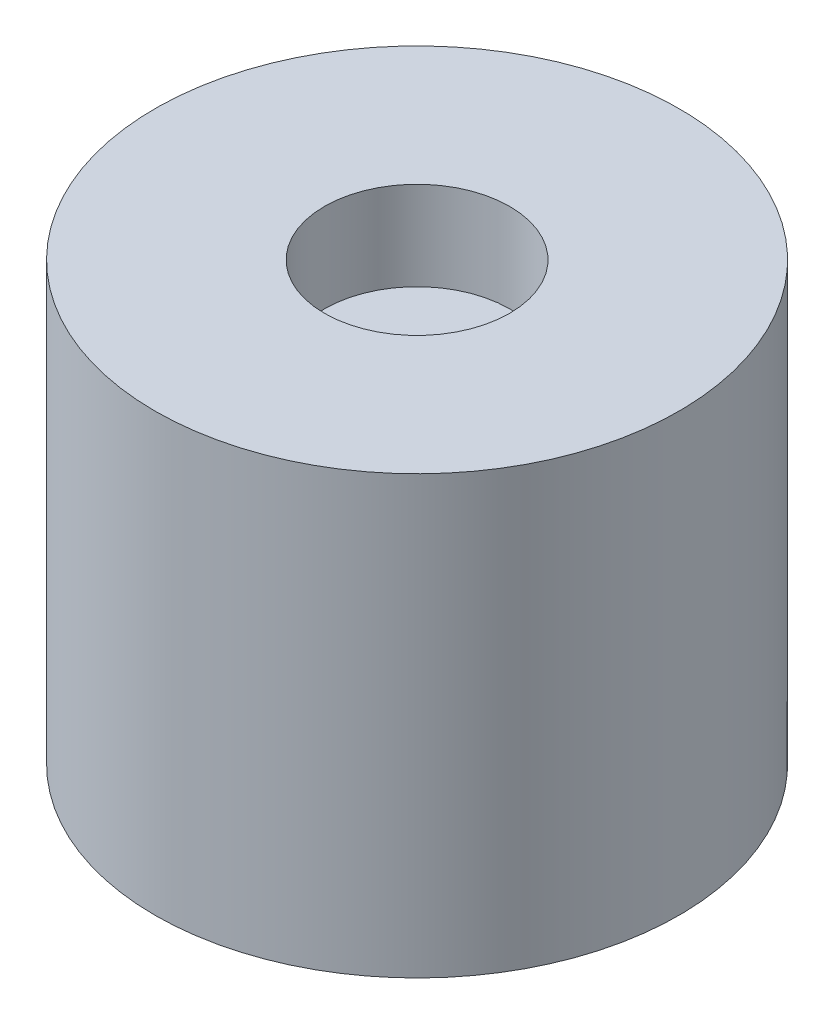
ISO-10303-21;
HEADER;
FILE_DESCRIPTION(('STEP AP214'),'2;1');
FILE_NAME('part.step','',(''),(''),'','','');
FILE_SCHEMA(('AUTOMOTIVE_DESIGN { 1 0 10303 214 1 1 1 1 }'));
ENDSEC;
DATA;
#1=APPLICATION_CONTEXT('core data for automotive mechanical design processes');
#2=APPLICATION_PROTOCOL_DEFINITION('international standard','automotive_design',2000,#1);
#3=PRODUCT_CONTEXT('',#1,'mechanical');
#4=PRODUCT('Part','Part','',(#3));
#5=PRODUCT_RELATED_PRODUCT_CATEGORY('part','',(#4));
#6=PRODUCT_DEFINITION_FORMATION('','',#4);
#7=PRODUCT_DEFINITION_CONTEXT('part definition',#1,'design');
#8=PRODUCT_DEFINITION('design','',#6,#7);
#9=PRODUCT_DEFINITION_SHAPE('','',#8);
#10=(LENGTH_UNIT() NAMED_UNIT(*) SI_UNIT(.MILLI.,.METRE.));
#11=(NAMED_UNIT(*) PLANE_ANGLE_UNIT() SI_UNIT($,.RADIAN.));
#12=(NAMED_UNIT(*) SI_UNIT($,.STERADIAN.) SOLID_ANGLE_UNIT());
#13=UNCERTAINTY_MEASURE_WITH_UNIT(LENGTH_MEASURE(1.E-05),#10,'distance_accuracy_value','');
#14=(GEOMETRIC_REPRESENTATION_CONTEXT(3) GLOBAL_UNCERTAINTY_ASSIGNED_CONTEXT((#13)) GLOBAL_UNIT_ASSIGNED_CONTEXT((#10,
#11,#12)) REPRESENTATION_CONTEXT('',''));
#15=CARTESIAN_POINT('',(0.,0.,0.));
#16=DIRECTION('',(0.,0.,1.));
#17=DIRECTION('',(1.,0.,0.));
#18=AXIS2_PLACEMENT_3D('',#15,#16,#17);
#19=CARTESIAN_POINT('',(0.,10.,0.));
#20=DIRECTION('',(0.,-1.,0.));
#21=DIRECTION('',(0.,0.,-1.));
#22=AXIS2_PLACEMENT_3D('',#19,#20,#21);
#23=CYLINDRICAL_SURFACE('',#22,6.);
#24=CARTESIAN_POINT('',(0.,10.,0.));
#25=DIRECTION('',(0.,1.,0.));
#26=DIRECTION('',(0.,0.,1.));
#27=AXIS2_PLACEMENT_3D('',#24,#25,#26);
#28=CIRCLE('',#27,6.);
#29=CARTESIAN_POINT('',(0.,10.,6.));
#30=VERTEX_POINT('',#29);
#31=EDGE_CURVE('E11',#30,#30,#28,.T.);
#32=ORIENTED_EDGE('',*,*,#31,.F.);
#33=EDGE_LOOP('',(#32));
#34=FACE_BOUND('',#33,.T.);
#35=CARTESIAN_POINT('',(0.,0.,0.));
#36=DIRECTION('',(0.,1.,0.));
#37=DIRECTION('',(0.,0.,1.));
#38=AXIS2_PLACEMENT_3D('',#35,#36,#37);
#39=CIRCLE('',#38,6.);
#40=CARTESIAN_POINT('',(0.,0.,6.));
#41=VERTEX_POINT('',#40);
#42=EDGE_CURVE('E42',#41,#41,#39,.T.);
#43=ORIENTED_EDGE('',*,*,#42,.T.);
#44=EDGE_LOOP('',(#43));
#45=FACE_BOUND('',#44,.T.);
#46=ADVANCED_FACE('F39',(#34,#45),#23,.T.);
#47=CARTESIAN_POINT('',(0.,10.,0.));
#48=DIRECTION('',(0.,1.,0.));
#49=DIRECTION('',(0.,0.,1.));
#50=AXIS2_PLACEMENT_3D('',#47,#48,#49);
#51=PLANE('',#50);
#52=CARTESIAN_POINT('',(0.,10.,0.));
#53=DIRECTION('',(0.,1.,0.));
#54=DIRECTION('',(0.,0.,1.));
#55=AXIS2_PLACEMENT_3D('',#52,#53,#54);
#56=CIRCLE('',#55,2.1209);
#57=CARTESIAN_POINT('',(0.,10.,2.1209));
#58=VERTEX_POINT('',#57);
#59=EDGE_CURVE('E53',#58,#58,#56,.T.);
#60=ORIENTED_EDGE('',*,*,#59,.F.);
#61=EDGE_LOOP('',(#60));
#62=FACE_BOUND('',#61,.T.);
#63=ORIENTED_EDGE('',*,*,#31,.T.);
#64=EDGE_LOOP('',(#63));
#65=FACE_BOUND('',#64,.T.);
#66=ADVANCED_FACE('F76',(#62,#65),#51,.T.);
#67=CARTESIAN_POINT('',(0.,0.,0.));
#68=DIRECTION('',(0.,1.,0.));
#69=DIRECTION('',(0.,0.,1.));
#70=AXIS2_PLACEMENT_3D('',#67,#68,#69);
#71=PLANE('',#70);
#72=CARTESIAN_POINT('',(0.,0.,0.));
#73=DIRECTION('',(0.,-1.,0.));
#74=DIRECTION('',(0.,0.,-1.));
#75=AXIS2_PLACEMENT_3D('',#72,#73,#74);
#76=CIRCLE('',#75,4.05);
#77=CARTESIAN_POINT('',(0.,0.,-4.05));
#78=VERTEX_POINT('',#77);
#79=EDGE_CURVE('E64',#78,#78,#76,.T.);
#80=ORIENTED_EDGE('',*,*,#79,.F.);
#81=EDGE_LOOP('',(#80));
#82=FACE_BOUND('',#81,.T.);
#83=ORIENTED_EDGE('',*,*,#42,.F.);
#84=EDGE_LOOP('',(#83));
#85=FACE_BOUND('',#84,.T.);
#86=ADVANCED_FACE('F72',(#82,#85),#71,.F.);
#87=CARTESIAN_POINT('',(0.,7.968,0.));
#88=DIRECTION('',(0.,1.,0.));
#89=DIRECTION('',(0.,0.,1.));
#90=AXIS2_PLACEMENT_3D('',#87,#88,#89);
#91=CYLINDRICAL_SURFACE('',#90,2.1209);
#92=CARTESIAN_POINT('',(0.,7.968,0.));
#93=DIRECTION('',(0.,1.,0.));
#94=DIRECTION('',(0.,0.,1.));
#95=AXIS2_PLACEMENT_3D('',#92,#93,#94);
#96=CIRCLE('',#95,2.1209);
#97=CARTESIAN_POINT('',(0.,7.968,2.1209));
#98=VERTEX_POINT('',#97);
#99=EDGE_CURVE('E51',#98,#98,#96,.T.);
#100=ORIENTED_EDGE('',*,*,#99,.F.);
#101=EDGE_LOOP('',(#100));
#102=FACE_BOUND('',#101,.T.);
#103=ORIENTED_EDGE('',*,*,#59,.T.);
#104=EDGE_LOOP('',(#103));
#105=FACE_BOUND('',#104,.T.);
#106=ADVANCED_FACE('F75',(#102,#105),#91,.F.);
#107=CARTESIAN_POINT('',(0.,7.968,0.));
#108=DIRECTION('',(0.,1.,0.));
#109=DIRECTION('',(0.,0.,1.));
#110=AXIS2_PLACEMENT_3D('',#107,#108,#109);
#111=PLANE('',#110);
#112=ORIENTED_EDGE('',*,*,#99,.T.);
#113=EDGE_LOOP('',(#112));
#114=FACE_BOUND('',#113,.T.);
#115=ADVANCED_FACE('F92',(#114),#111,.T.);
#116=CARTESIAN_POINT('',(0.,6.968,0.));
#117=DIRECTION('',(0.,1.,0.));
#118=DIRECTION('',(0.,0.,1.));
#119=AXIS2_PLACEMENT_3D('',#116,#117,#118);
#120=PLANE('',#119);
#121=CARTESIAN_POINT('',(0.,6.968,0.));
#122=DIRECTION('',(0.,1.,0.));
#123=DIRECTION('',(0.,0.,1.));
#124=AXIS2_PLACEMENT_3D('',#121,#122,#123);
#125=CIRCLE('',#124,4.05);
#126=CARTESIAN_POINT('',(0.,6.968,4.05));
#127=VERTEX_POINT('',#126);
#128=EDGE_CURVE('E57',#127,#127,#125,.F.);
#129=ORIENTED_EDGE('',*,*,#128,.T.);
#130=EDGE_LOOP('',(#129));
#131=FACE_BOUND('',#130,.T.);
#132=ADVANCED_FACE('F96',(#131),#120,.F.);
#133=CARTESIAN_POINT('',(0.,19.4231298552221,0.));
#134=DIRECTION('',(0.,-1.,0.));
#135=DIRECTION('',(0.,0.,-1.));
#136=AXIS2_PLACEMENT_3D('',#133,#134,#135);
#137=CYLINDRICAL_SURFACE('',#136,4.05);
#138=ORIENTED_EDGE('',*,*,#79,.T.);
#139=EDGE_LOOP('',(#138));
#140=FACE_BOUND('',#139,.T.);
#141=ORIENTED_EDGE('',*,*,#128,.F.);
#142=EDGE_LOOP('',(#141));
#143=FACE_BOUND('',#142,.T.);
#144=ADVANCED_FACE('F69',(#140,#143),#137,.F.);
#145=CLOSED_SHELL('',(#46,#66,#86,#106,#115,#132,#144));
#146=MANIFOLD_SOLID_BREP('B2',#145);
#147=ADVANCED_BREP_SHAPE_REPRESENTATION('',(#18,#146),#14);
#148=SHAPE_DEFINITION_REPRESENTATION(#9,#147);
ENDSEC;
END-ISO-10303-21;
